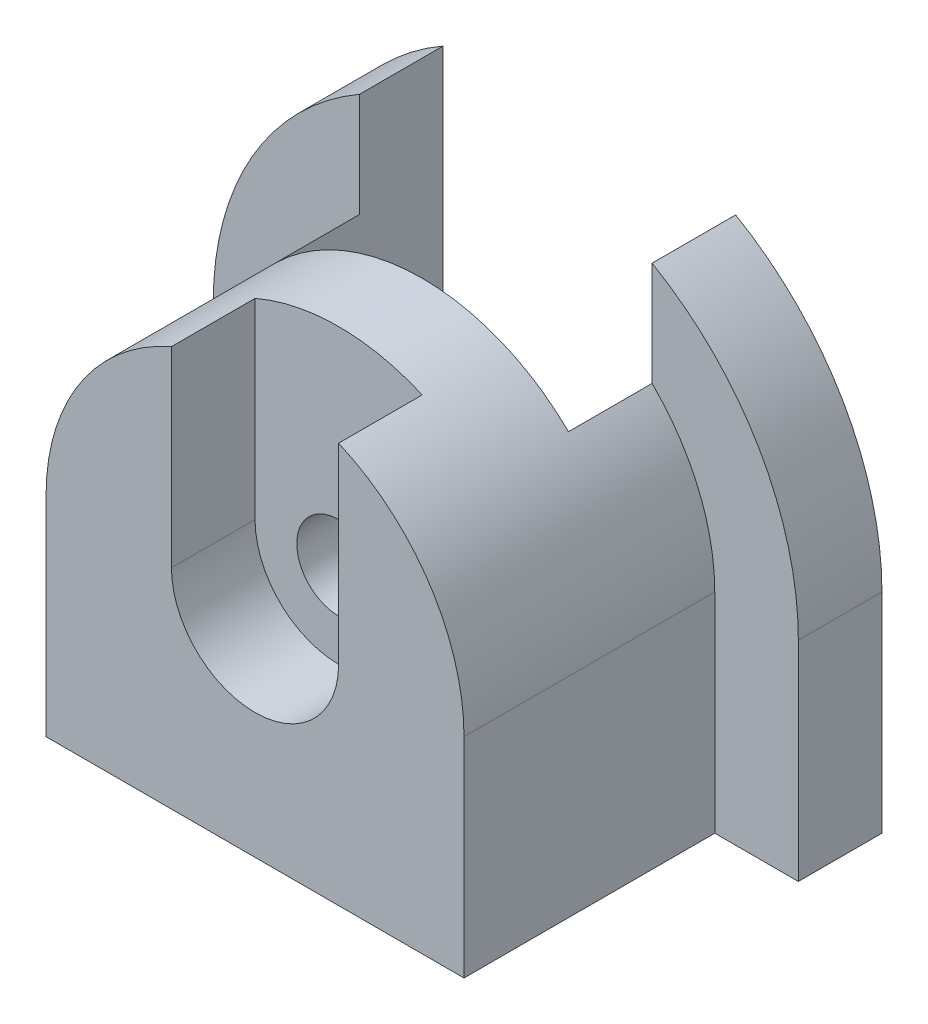
ISO-10303-21;
HEADER;
FILE_DESCRIPTION(('STEP AP214'),'2;1');
FILE_NAME('part.step','',(''),(''),'','','');
FILE_SCHEMA(('AUTOMOTIVE_DESIGN { 1 0 10303 214 1 1 1 1 }'));
ENDSEC;
DATA;
#1=APPLICATION_CONTEXT('core data for automotive mechanical design processes');
#2=APPLICATION_PROTOCOL_DEFINITION('international standard','automotive_design',2000,#1);
#3=PRODUCT_CONTEXT('',#1,'mechanical');
#4=PRODUCT('Part','Part','',(#3));
#5=PRODUCT_RELATED_PRODUCT_CATEGORY('part','',(#4));
#6=PRODUCT_DEFINITION_FORMATION('','',#4);
#7=PRODUCT_DEFINITION_CONTEXT('part definition',#1,'design');
#8=PRODUCT_DEFINITION('design','',#6,#7);
#9=PRODUCT_DEFINITION_SHAPE('','',#8);
#10=(LENGTH_UNIT() NAMED_UNIT(*) SI_UNIT(.MILLI.,.METRE.));
#11=(NAMED_UNIT(*) PLANE_ANGLE_UNIT() SI_UNIT($,.RADIAN.));
#12=(NAMED_UNIT(*) SI_UNIT($,.STERADIAN.) SOLID_ANGLE_UNIT());
#13=UNCERTAINTY_MEASURE_WITH_UNIT(LENGTH_MEASURE(1.E-05),#10,'distance_accuracy_value','');
#14=(GEOMETRIC_REPRESENTATION_CONTEXT(3) GLOBAL_UNCERTAINTY_ASSIGNED_CONTEXT((#13)) GLOBAL_UNIT_ASSIGNED_CONTEXT((#10,
#11,#12)) REPRESENTATION_CONTEXT('',''));
#15=CARTESIAN_POINT('',(0.,0.,0.));
#16=DIRECTION('',(0.,0.,1.));
#17=DIRECTION('',(1.,0.,0.));
#18=AXIS2_PLACEMENT_3D('',#15,#16,#17);
#19=CARTESIAN_POINT('',(0.,0.,-20.));
#20=DIRECTION('',(0.,0.,-1.));
#21=DIRECTION('',(-1.,0.,0.));
#22=AXIS2_PLACEMENT_3D('',#19,#20,#21);
#23=PLANE('',#22);
#24=DIRECTION('',(0.,1.,0.));
#25=VECTOR('',#24,1.);
#26=CARTESIAN_POINT('',(-20.,0.,-20.));
#27=LINE('',#26,#25);
#28=CARTESIAN_POINT('',(-20.,-50.,-20.));
#29=VERTEX_POINT('',#28);
#30=CARTESIAN_POINT('',(-20.,-28.7228132326901,-20.));
#31=VERTEX_POINT('',#30);
#32=EDGE_CURVE('E43',#29,#31,#27,.T.);
#33=ORIENTED_EDGE('',*,*,#32,.F.);
#34=DIRECTION('',(1.,0.,0.));
#35=VECTOR('',#34,1.);
#36=CARTESIAN_POINT('',(0.,-50.,-20.));
#37=LINE('',#36,#35);
#38=CARTESIAN_POINT('',(-70.,-50.,-20.));
#39=VERTEX_POINT('',#38);
#40=EDGE_CURVE('E198',#39,#29,#37,.T.);
#41=ORIENTED_EDGE('',*,*,#40,.F.);
#42=DIRECTION('',(0.,-1.,0.));
#43=VECTOR('',#42,1.);
#44=CARTESIAN_POINT('',(-70.,0.,-20.));
#45=LINE('',#44,#43);
#46=CARTESIAN_POINT('',(-70.,0.,-20.));
#47=VERTEX_POINT('',#46);
#48=EDGE_CURVE('E682',#47,#39,#45,.T.);
#49=ORIENTED_EDGE('',*,*,#48,.F.);
#50=CARTESIAN_POINT('',(0.,0.,-20.));
#51=DIRECTION('',(0.,0.,-1.));
#52=DIRECTION('',(-1.,0.,0.));
#53=AXIS2_PLACEMENT_3D('',#50,#51,#52);
#54=CIRCLE('',#53,70.);
#55=CARTESIAN_POINT('',(-35.,60.6217782649107,-20.));
#56=VERTEX_POINT('',#55);
#57=EDGE_CURVE('E685',#47,#56,#54,.T.);
#58=ORIENTED_EDGE('',*,*,#57,.T.);
#59=DIRECTION('',(0.,-1.,0.));
#60=VECTOR('',#59,1.);
#61=CARTESIAN_POINT('',(-35.,0.,-20.));
#62=LINE('',#61,#60);
#63=CARTESIAN_POINT('',(-35.,0.,-20.));
#64=VERTEX_POINT('',#63);
#65=EDGE_CURVE('E680',#56,#64,#62,.T.);
#66=ORIENTED_EDGE('',*,*,#65,.T.);
#67=CARTESIAN_POINT('',(0.,0.,-20.));
#68=DIRECTION('',(0.,0.,-1.));
#69=DIRECTION('',(-1.,0.,0.));
#70=AXIS2_PLACEMENT_3D('',#67,#68,#69);
#71=CIRCLE('',#70,35.);
#72=EDGE_CURVE('E202',#64,#31,#71,.F.);
#73=ORIENTED_EDGE('',*,*,#72,.T.);
#74=EDGE_LOOP('',(#33,#41,#49,#58,#66,#73));
#75=FACE_BOUND('',#74,.T.);
#76=ADVANCED_FACE('F35',(#75),#23,.T.);
#77=CARTESIAN_POINT('',(35.,0.,20.));
#78=DIRECTION('',(-1.,0.,0.));
#79=DIRECTION('',(0.,0.,1.));
#80=AXIS2_PLACEMENT_3D('',#77,#78,#79);
#81=PLANE('',#80);
#82=DIRECTION('',(0.,-1.,0.));
#83=VECTOR('',#82,1.);
#84=CARTESIAN_POINT('',(35.,0.,-20.));
#85=LINE('',#84,#83);
#86=CARTESIAN_POINT('',(35.,60.6217782649107,-20.));
#87=VERTEX_POINT('',#86);
#88=CARTESIAN_POINT('',(35.,0.,-20.));
#89=VERTEX_POINT('',#88);
#90=EDGE_CURVE('E208',#87,#89,#85,.T.);
#91=ORIENTED_EDGE('',*,*,#90,.T.);
#92=DIRECTION('',(0.,0.,-1.));
#93=VECTOR('',#92,1.);
#94=CARTESIAN_POINT('',(35.,0.,20.));
#95=LINE('',#94,#93);
#96=CARTESIAN_POINT('',(35.,0.,20.));
#97=VERTEX_POINT('',#96);
#98=EDGE_CURVE('E272',#97,#89,#95,.T.);
#99=ORIENTED_EDGE('',*,*,#98,.F.);
#100=DIRECTION('',(0.,1.,0.));
#101=VECTOR('',#100,1.);
#102=CARTESIAN_POINT('',(35.,0.,20.));
#103=LINE('',#102,#101);
#104=CARTESIAN_POINT('',(35.,35.7071421427143,20.));
#105=VERTEX_POINT('',#104);
#106=EDGE_CURVE('E246',#97,#105,#103,.T.);
#107=ORIENTED_EDGE('',*,*,#106,.T.);
#108=DIRECTION('',(0.,0.,-1.));
#109=VECTOR('',#108,1.);
#110=CARTESIAN_POINT('',(35.,35.7071421427143,20.));
#111=LINE('',#110,#109);
#112=CARTESIAN_POINT('',(35.,35.7071421427143,0.));
#113=VERTEX_POINT('',#112);
#114=EDGE_CURVE('E255',#105,#113,#111,.T.);
#115=ORIENTED_EDGE('',*,*,#114,.T.);
#116=DIRECTION('',(0.,-1.,0.));
#117=VECTOR('',#116,1.);
#118=CARTESIAN_POINT('',(35.,0.,0.));
#119=LINE('',#118,#117);
#120=CARTESIAN_POINT('',(35.,60.6217782649107,0.));
#121=VERTEX_POINT('',#120);
#122=EDGE_CURVE('E232',#121,#113,#119,.T.);
#123=ORIENTED_EDGE('',*,*,#122,.F.);
#124=DIRECTION('',(0.,0.,1.));
#125=VECTOR('',#124,1.);
#126=CARTESIAN_POINT('',(35.,60.6217782649107,-20.));
#127=LINE('',#126,#125);
#128=EDGE_CURVE('E233',#87,#121,#127,.T.);
#129=ORIENTED_EDGE('',*,*,#128,.F.);
#130=EDGE_LOOP('',(#91,#99,#107,#115,#123,#129));
#131=FACE_BOUND('',#130,.T.);
#132=ADVANCED_FACE('F342',(#131),#81,.T.);
#133=CARTESIAN_POINT('',(-35.,0.,20.));
#134=DIRECTION('',(-1.,0.,0.));
#135=DIRECTION('',(0.,0.,1.));
#136=AXIS2_PLACEMENT_3D('',#133,#134,#135);
#137=PLANE('',#136);
#138=DIRECTION('',(0.,0.,-1.));
#139=VECTOR('',#138,1.);
#140=CARTESIAN_POINT('',(-35.,0.,20.));
#141=LINE('',#140,#139);
#142=CARTESIAN_POINT('',(-35.,0.,20.));
#143=VERTEX_POINT('',#142);
#144=EDGE_CURVE('E251',#143,#64,#141,.T.);
#145=ORIENTED_EDGE('',*,*,#144,.T.);
#146=ORIENTED_EDGE('',*,*,#65,.F.);
#147=DIRECTION('',(0.,0.,1.));
#148=VECTOR('',#147,1.);
#149=CARTESIAN_POINT('',(-35.,60.6217782649107,-20.));
#150=LINE('',#149,#148);
#151=CARTESIAN_POINT('',(-35.,60.6217782649107,0.));
#152=VERTEX_POINT('',#151);
#153=EDGE_CURVE('E687',#56,#152,#150,.T.);
#154=ORIENTED_EDGE('',*,*,#153,.T.);
#155=DIRECTION('',(0.,-1.,0.));
#156=VECTOR('',#155,1.);
#157=CARTESIAN_POINT('',(-35.,0.,0.));
#158=LINE('',#157,#156);
#159=CARTESIAN_POINT('',(-35.,35.7071421427143,0.));
#160=VERTEX_POINT('',#159);
#161=EDGE_CURVE('E384',#152,#160,#158,.T.);
#162=ORIENTED_EDGE('',*,*,#161,.T.);
#163=DIRECTION('',(0.,0.,-1.));
#164=VECTOR('',#163,1.);
#165=CARTESIAN_POINT('',(-35.,35.7071421427143,20.));
#166=LINE('',#165,#164);
#167=CARTESIAN_POINT('',(-35.,35.7071421427143,20.));
#168=VERTEX_POINT('',#167);
#169=EDGE_CURVE('E252',#168,#160,#166,.T.);
#170=ORIENTED_EDGE('',*,*,#169,.F.);
#171=DIRECTION('',(0.,1.,0.));
#172=VECTOR('',#171,1.);
#173=CARTESIAN_POINT('',(-35.,0.,20.));
#174=LINE('',#173,#172);
#175=EDGE_CURVE('E240',#143,#168,#174,.T.);
#176=ORIENTED_EDGE('',*,*,#175,.F.);
#177=EDGE_LOOP('',(#145,#146,#154,#162,#170,#176));
#178=FACE_BOUND('',#177,.T.);
#179=ADVANCED_FACE('F380',(#178),#137,.F.);
#180=CARTESIAN_POINT('',(0.,0.,60.));
#181=DIRECTION('',(0.,0.,-1.));
#182=DIRECTION('',(-1.,0.,0.));
#183=AXIS2_PLACEMENT_3D('',#180,#181,#182);
#184=CYLINDRICAL_SURFACE('',#183,50.);
#185=CARTESIAN_POINT('',(0.,0.,0.));
#186=DIRECTION('',(0.,0.,1.));
#187=DIRECTION('',(1.,0.,0.));
#188=AXIS2_PLACEMENT_3D('',#185,#186,#187);
#189=CIRCLE('',#188,50.);
#190=CARTESIAN_POINT('',(50.,0.,0.));
#191=VERTEX_POINT('',#190);
#192=EDGE_CURVE('E302',#113,#191,#189,.F.);
#193=ORIENTED_EDGE('',*,*,#192,.F.);
#194=ORIENTED_EDGE('',*,*,#114,.F.);
#195=CARTESIAN_POINT('',(0.,0.,20.));
#196=DIRECTION('',(0.,0.,-1.));
#197=DIRECTION('',(-1.,0.,0.));
#198=AXIS2_PLACEMENT_3D('',#195,#196,#197);
#199=CIRCLE('',#198,50.);
#200=EDGE_CURVE('E243',#168,#105,#199,.T.);
#201=ORIENTED_EDGE('',*,*,#200,.F.);
#202=ORIENTED_EDGE('',*,*,#169,.T.);
#203=CARTESIAN_POINT('',(-50.,0.,0.));
#204=VERTEX_POINT('',#203);
#205=EDGE_CURVE('E297',#204,#160,#189,.F.);
#206=ORIENTED_EDGE('',*,*,#205,.F.);
#207=DIRECTION('',(0.,0.,-1.));
#208=VECTOR('',#207,1.);
#209=CARTESIAN_POINT('',(-50.,0.,60.));
#210=LINE('',#209,#208);
#211=CARTESIAN_POINT('',(-50.,0.,60.));
#212=VERTEX_POINT('',#211);
#213=EDGE_CURVE('E320',#212,#204,#210,.T.);
#214=ORIENTED_EDGE('',*,*,#213,.F.);
#215=CARTESIAN_POINT('',(0.,0.,60.));
#216=DIRECTION('',(0.,0.,1.));
#217=DIRECTION('',(1.,0.,0.));
#218=AXIS2_PLACEMENT_3D('',#215,#216,#217);
#219=CIRCLE('',#218,50.);
#220=CARTESIAN_POINT('',(-20.,45.8257569495584,60.));
#221=VERTEX_POINT('',#220);
#222=EDGE_CURVE('E285',#212,#221,#219,.F.);
#223=ORIENTED_EDGE('',*,*,#222,.T.);
#224=DIRECTION('',(0.,0.,1.));
#225=VECTOR('',#224,1.);
#226=CARTESIAN_POINT('',(-20.,45.8257569495584,40.));
#227=LINE('',#226,#225);
#228=CARTESIAN_POINT('',(-20.,45.8257569495584,40.));
#229=VERTEX_POINT('',#228);
#230=EDGE_CURVE('E279',#229,#221,#227,.T.);
#231=ORIENTED_EDGE('',*,*,#230,.F.);
#232=CARTESIAN_POINT('',(0.,0.,40.));
#233=DIRECTION('',(0.,0.,1.));
#234=DIRECTION('',(-1.,0.,0.));
#235=AXIS2_PLACEMENT_3D('',#232,#233,#234);
#236=CIRCLE('',#235,50.);
#237=CARTESIAN_POINT('',(20.,45.8257569495584,40.));
#238=VERTEX_POINT('',#237);
#239=EDGE_CURVE('E264',#238,#229,#236,.T.);
#240=ORIENTED_EDGE('',*,*,#239,.F.);
#241=DIRECTION('',(0.,0.,1.));
#242=VECTOR('',#241,1.);
#243=CARTESIAN_POINT('',(20.,45.8257569495584,40.));
#244=LINE('',#243,#242);
#245=CARTESIAN_POINT('',(20.,45.8257569495584,60.));
#246=VERTEX_POINT('',#245);
#247=EDGE_CURVE('E281',#238,#246,#244,.T.);
#248=ORIENTED_EDGE('',*,*,#247,.T.);
#249=CARTESIAN_POINT('',(50.,0.,60.));
#250=VERTEX_POINT('',#249);
#251=EDGE_CURVE('E289',#246,#250,#219,.F.);
#252=ORIENTED_EDGE('',*,*,#251,.T.);
#253=DIRECTION('',(0.,0.,-1.));
#254=VECTOR('',#253,1.);
#255=CARTESIAN_POINT('',(50.,0.,60.));
#256=LINE('',#255,#254);
#257=EDGE_CURVE('E296',#250,#191,#256,.T.);
#258=ORIENTED_EDGE('',*,*,#257,.T.);
#259=EDGE_LOOP('',(#193,#194,#201,#202,#206,#214,#223,#231,#240,#248,#252,#258));
#260=FACE_BOUND('',#259,.T.);
#261=ADVANCED_FACE('F37',(#260),#184,.T.);
#262=CARTESIAN_POINT('',(0.,0.,0.));
#263=DIRECTION('',(0.,0.,1.));
#264=DIRECTION('',(1.,0.,0.));
#265=AXIS2_PLACEMENT_3D('',#262,#263,#264);
#266=CYLINDRICAL_SURFACE('',#265,10.);
#267=CARTESIAN_POINT('',(0.,0.,40.));
#268=DIRECTION('',(0.,0.,-1.));
#269=DIRECTION('',(-1.,0.,0.));
#270=AXIS2_PLACEMENT_3D('',#267,#268,#269);
#271=CIRCLE('',#270,10.);
#272=CARTESIAN_POINT('',(-10.,0.,40.));
#273=VERTEX_POINT('',#272);
#274=EDGE_CURVE('E278',#273,#273,#271,.F.);
#275=ORIENTED_EDGE('',*,*,#274,.T.);
#276=EDGE_LOOP('',(#275));
#277=FACE_BOUND('',#276,.T.);
#278=CARTESIAN_POINT('',(0.,0.,20.));
#279=DIRECTION('',(0.,0.,-1.));
#280=DIRECTION('',(-1.,0.,0.));
#281=AXIS2_PLACEMENT_3D('',#278,#279,#280);
#282=CIRCLE('',#281,10.);
#283=CARTESIAN_POINT('',(-10.,0.,20.));
#284=VERTEX_POINT('',#283);
#285=EDGE_CURVE('E248',#284,#284,#282,.F.);
#286=ORIENTED_EDGE('',*,*,#285,.F.);
#287=EDGE_LOOP('',(#286));
#288=FACE_BOUND('',#287,.T.);
#289=ADVANCED_FACE('F580',(#277,#288),#266,.F.);
#290=CARTESIAN_POINT('',(-50.,0.,60.));
#291=DIRECTION('',(1.,0.,0.));
#292=DIRECTION('',(0.,1.,0.));
#293=AXIS2_PLACEMENT_3D('',#290,#291,#292);
#294=PLANE('',#293);
#295=DIRECTION('',(0.,-1.,0.));
#296=VECTOR('',#295,1.);
#297=CARTESIAN_POINT('',(-50.,0.,0.));
#298=LINE('',#297,#296);
#299=CARTESIAN_POINT('',(-50.,-50.,0.));
#300=VERTEX_POINT('',#299);
#301=EDGE_CURVE('E301',#204,#300,#298,.T.);
#302=ORIENTED_EDGE('',*,*,#301,.T.);
#303=DIRECTION('',(0.,0.,-1.));
#304=VECTOR('',#303,1.);
#305=CARTESIAN_POINT('',(-50.,-50.,60.));
#306=LINE('',#305,#304);
#307=CARTESIAN_POINT('',(-50.,-50.,60.));
#308=VERTEX_POINT('',#307);
#309=EDGE_CURVE('E317',#308,#300,#306,.T.);
#310=ORIENTED_EDGE('',*,*,#309,.F.);
#311=DIRECTION('',(0.,-1.,0.));
#312=VECTOR('',#311,1.);
#313=CARTESIAN_POINT('',(-50.,0.,60.));
#314=LINE('',#313,#312);
#315=EDGE_CURVE('E288',#212,#308,#314,.T.);
#316=ORIENTED_EDGE('',*,*,#315,.F.);
#317=ORIENTED_EDGE('',*,*,#213,.T.);
#318=EDGE_LOOP('',(#302,#310,#316,#317));
#319=FACE_BOUND('',#318,.T.);
#320=ADVANCED_FACE('F391',(#319),#294,.F.);
#321=CARTESIAN_POINT('',(0.,-50.,60.));
#322=DIRECTION('',(0.,1.,0.));
#323=DIRECTION('',(0.,0.,1.));
#324=AXIS2_PLACEMENT_3D('',#321,#322,#323);
#325=PLANE('',#324);
#326=ORIENTED_EDGE('',*,*,#40,.T.);
#327=DIRECTION('',(0.,0.,-1.));
#328=VECTOR('',#327,1.);
#329=CARTESIAN_POINT('',(-20.,-50.,-20.));
#330=LINE('',#329,#328);
#331=CARTESIAN_POINT('',(-20.,-50.,-10.));
#332=VERTEX_POINT('',#331);
#333=EDGE_CURVE('E183',#332,#29,#330,.T.);
#334=ORIENTED_EDGE('',*,*,#333,.F.);
#335=DIRECTION('',(-1.,0.,0.));
#336=VECTOR('',#335,1.);
#337=CARTESIAN_POINT('',(-20.,-50.,-10.));
#338=LINE('',#337,#336);
#339=CARTESIAN_POINT('',(20.,-50.,-10.));
#340=VERTEX_POINT('',#339);
#341=EDGE_CURVE('E674',#340,#332,#338,.T.);
#342=ORIENTED_EDGE('',*,*,#341,.F.);
#343=DIRECTION('',(0.,0.,1.));
#344=VECTOR('',#343,1.);
#345=CARTESIAN_POINT('',(20.,-50.,-20.));
#346=LINE('',#345,#344);
#347=CARTESIAN_POINT('',(20.,-50.,-20.));
#348=VERTEX_POINT('',#347);
#349=EDGE_CURVE('E193',#348,#340,#346,.T.);
#350=ORIENTED_EDGE('',*,*,#349,.F.);
#351=CARTESIAN_POINT('',(70.,-50.,-20.));
#352=VERTEX_POINT('',#351);
#353=EDGE_CURVE('E209',#348,#352,#37,.T.);
#354=ORIENTED_EDGE('',*,*,#353,.T.);
#355=DIRECTION('',(0.,0.,1.));
#356=VECTOR('',#355,1.);
#357=CARTESIAN_POINT('',(70.,-50.,-20.));
#358=LINE('',#357,#356);
#359=CARTESIAN_POINT('',(70.,-50.,0.));
#360=VERTEX_POINT('',#359);
#361=EDGE_CURVE('E223',#352,#360,#358,.T.);
#362=ORIENTED_EDGE('',*,*,#361,.T.);
#363=DIRECTION('',(1.,0.,0.));
#364=VECTOR('',#363,1.);
#365=CARTESIAN_POINT('',(0.,-50.,0.));
#366=LINE('',#365,#364);
#367=CARTESIAN_POINT('',(50.,-50.,0.));
#368=VERTEX_POINT('',#367);
#369=EDGE_CURVE('E229',#368,#360,#366,.T.);
#370=ORIENTED_EDGE('',*,*,#369,.F.);
#371=DIRECTION('',(0.,0.,-1.));
#372=VECTOR('',#371,1.);
#373=CARTESIAN_POINT('',(50.,-50.,60.));
#374=LINE('',#373,#372);
#375=CARTESIAN_POINT('',(50.,-50.,60.));
#376=VERTEX_POINT('',#375);
#377=EDGE_CURVE('E314',#376,#368,#374,.T.);
#378=ORIENTED_EDGE('',*,*,#377,.F.);
#379=DIRECTION('',(1.,0.,0.));
#380=VECTOR('',#379,1.);
#381=CARTESIAN_POINT('',(0.,-50.,60.));
#382=LINE('',#381,#380);
#383=EDGE_CURVE('E291',#308,#376,#382,.T.);
#384=ORIENTED_EDGE('',*,*,#383,.F.);
#385=ORIENTED_EDGE('',*,*,#309,.T.);
#386=DIRECTION('',(-1.,0.,0.));
#387=VECTOR('',#386,1.);
#388=CARTESIAN_POINT('',(0.,-50.,0.));
#389=LINE('',#388,#387);
#390=CARTESIAN_POINT('',(-70.,-50.,0.));
#391=VERTEX_POINT('',#390);
#392=EDGE_CURVE('E389',#300,#391,#389,.T.);
#393=ORIENTED_EDGE('',*,*,#392,.T.);
#394=DIRECTION('',(0.,0.,1.));
#395=VECTOR('',#394,1.);
#396=CARTESIAN_POINT('',(-70.,-50.,-20.));
#397=LINE('',#396,#395);
#398=EDGE_CURVE('E206',#39,#391,#397,.T.);
#399=ORIENTED_EDGE('',*,*,#398,.F.);
#400=EDGE_LOOP('',(#326,#334,#342,#350,#354,#362,#370,#378,#384,#385,#393,#399));
#401=FACE_BOUND('',#400,.T.);
#402=ADVANCED_FACE('F204',(#401),#325,.F.);
#403=CARTESIAN_POINT('',(50.,0.,60.));
#404=DIRECTION('',(-1.,0.,0.));
#405=DIRECTION('',(0.,-1.,0.));
#406=AXIS2_PLACEMENT_3D('',#403,#404,#405);
#407=PLANE('',#406);
#408=DIRECTION('',(0.,1.,0.));
#409=VECTOR('',#408,1.);
#410=CARTESIAN_POINT('',(50.,0.,0.));
#411=LINE('',#410,#409);
#412=EDGE_CURVE('E309',#368,#191,#411,.T.);
#413=ORIENTED_EDGE('',*,*,#412,.T.);
#414=ORIENTED_EDGE('',*,*,#257,.F.);
#415=DIRECTION('',(0.,1.,0.));
#416=VECTOR('',#415,1.);
#417=CARTESIAN_POINT('',(50.,0.,60.));
#418=LINE('',#417,#416);
#419=EDGE_CURVE('E293',#376,#250,#418,.T.);
#420=ORIENTED_EDGE('',*,*,#419,.F.);
#421=ORIENTED_EDGE('',*,*,#377,.T.);
#422=EDGE_LOOP('',(#413,#414,#420,#421));
#423=FACE_BOUND('',#422,.T.);
#424=ADVANCED_FACE('F540',(#423),#407,.F.);
#425=CARTESIAN_POINT('',(0.,0.,60.));
#426=DIRECTION('',(0.,0.,1.));
#427=DIRECTION('',(1.,0.,0.));
#428=AXIS2_PLACEMENT_3D('',#425,#426,#427);
#429=PLANE('',#428);
#430=DIRECTION('',(0.,-1.,0.));
#431=VECTOR('',#430,1.);
#432=CARTESIAN_POINT('',(-20.,0.,60.));
#433=LINE('',#432,#431);
#434=CARTESIAN_POINT('',(-20.,0.,60.));
#435=VERTEX_POINT('',#434);
#436=EDGE_CURVE('E261',#221,#435,#433,.T.);
#437=ORIENTED_EDGE('',*,*,#436,.F.);
#438=ORIENTED_EDGE('',*,*,#222,.F.);
#439=ORIENTED_EDGE('',*,*,#315,.T.);
#440=ORIENTED_EDGE('',*,*,#383,.T.);
#441=ORIENTED_EDGE('',*,*,#419,.T.);
#442=ORIENTED_EDGE('',*,*,#251,.F.);
#443=DIRECTION('',(0.,1.,0.));
#444=VECTOR('',#443,1.);
#445=CARTESIAN_POINT('',(20.,0.,60.));
#446=LINE('',#445,#444);
#447=CARTESIAN_POINT('',(20.,0.,60.));
#448=VERTEX_POINT('',#447);
#449=EDGE_CURVE('E271',#448,#246,#446,.T.);
#450=ORIENTED_EDGE('',*,*,#449,.F.);
#451=CARTESIAN_POINT('',(0.,0.,60.));
#452=DIRECTION('',(0.,0.,1.));
#453=DIRECTION('',(-1.,0.,0.));
#454=AXIS2_PLACEMENT_3D('',#451,#452,#453);
#455=CIRCLE('',#454,20.);
#456=EDGE_CURVE('E58',#435,#448,#455,.T.);
#457=ORIENTED_EDGE('',*,*,#456,.F.);
#458=EDGE_LOOP('',(#437,#438,#439,#440,#441,#442,#450,#457));
#459=FACE_BOUND('',#458,.T.);
#460=ADVANCED_FACE('F397',(#459),#429,.T.);
#461=CARTESIAN_POINT('',(0.,0.,40.));
#462=DIRECTION('',(0.,0.,-1.));
#463=DIRECTION('',(-1.,0.,0.));
#464=AXIS2_PLACEMENT_3D('',#461,#462,#463);
#465=PLANE('',#464);
#466=CARTESIAN_POINT('',(0.,0.,40.));
#467=DIRECTION('',(0.,0.,1.));
#468=DIRECTION('',(-1.,0.,0.));
#469=AXIS2_PLACEMENT_3D('',#466,#467,#468);
#470=CIRCLE('',#469,20.);
#471=CARTESIAN_POINT('',(-20.,0.,40.));
#472=VERTEX_POINT('',#471);
#473=CARTESIAN_POINT('',(20.,0.,40.));
#474=VERTEX_POINT('',#473);
#475=EDGE_CURVE('E257',#472,#474,#470,.T.);
#476=ORIENTED_EDGE('',*,*,#475,.T.);
#477=DIRECTION('',(0.,1.,0.));
#478=VECTOR('',#477,1.);
#479=CARTESIAN_POINT('',(20.,0.,40.));
#480=LINE('',#479,#478);
#481=EDGE_CURVE('E260',#474,#238,#480,.T.);
#482=ORIENTED_EDGE('',*,*,#481,.T.);
#483=ORIENTED_EDGE('',*,*,#239,.T.);
#484=DIRECTION('',(0.,-1.,0.));
#485=VECTOR('',#484,1.);
#486=CARTESIAN_POINT('',(-20.,0.,40.));
#487=LINE('',#486,#485);
#488=EDGE_CURVE('E266',#229,#472,#487,.T.);
#489=ORIENTED_EDGE('',*,*,#488,.T.);
#490=EDGE_LOOP('',(#476,#482,#483,#489));
#491=FACE_BOUND('',#490,.T.);
#492=ORIENTED_EDGE('',*,*,#274,.F.);
#493=EDGE_LOOP('',(#492));
#494=FACE_BOUND('',#493,.T.);
#495=ADVANCED_FACE('F407',(#491,#494),#465,.F.);
#496=CARTESIAN_POINT('',(0.,0.,40.));
#497=DIRECTION('',(0.,0.,1.));
#498=DIRECTION('',(1.,0.,0.));
#499=AXIS2_PLACEMENT_3D('',#496,#497,#498);
#500=CYLINDRICAL_SURFACE('',#499,20.);
#501=ORIENTED_EDGE('',*,*,#456,.T.);
#502=DIRECTION('',(0.,0.,1.));
#503=VECTOR('',#502,1.);
#504=CARTESIAN_POINT('',(20.,0.,40.));
#505=LINE('',#504,#503);
#506=EDGE_CURVE('E269',#474,#448,#505,.T.);
#507=ORIENTED_EDGE('',*,*,#506,.F.);
#508=ORIENTED_EDGE('',*,*,#475,.F.);
#509=DIRECTION('',(0.,0.,1.));
#510=VECTOR('',#509,1.);
#511=CARTESIAN_POINT('',(-20.,0.,40.));
#512=LINE('',#511,#510);
#513=EDGE_CURVE('E276',#472,#435,#512,.T.);
#514=ORIENTED_EDGE('',*,*,#513,.T.);
#515=EDGE_LOOP('',(#501,#507,#508,#514));
#516=FACE_BOUND('',#515,.T.);
#517=ADVANCED_FACE('F413',(#516),#500,.F.);
#518=CARTESIAN_POINT('',(-20.,0.,40.));
#519=DIRECTION('',(-1.,0.,0.));
#520=DIRECTION('',(0.,0.,1.));
#521=AXIS2_PLACEMENT_3D('',#518,#519,#520);
#522=PLANE('',#521);
#523=ORIENTED_EDGE('',*,*,#436,.T.);
#524=ORIENTED_EDGE('',*,*,#513,.F.);
#525=ORIENTED_EDGE('',*,*,#488,.F.);
#526=ORIENTED_EDGE('',*,*,#230,.T.);
#527=EDGE_LOOP('',(#523,#524,#525,#526));
#528=FACE_BOUND('',#527,.T.);
#529=ADVANCED_FACE('F404',(#528),#522,.F.);
#530=CARTESIAN_POINT('',(20.,0.,40.));
#531=DIRECTION('',(1.,0.,0.));
#532=DIRECTION('',(0.,0.,-1.));
#533=AXIS2_PLACEMENT_3D('',#530,#531,#532);
#534=PLANE('',#533);
#535=ORIENTED_EDGE('',*,*,#449,.T.);
#536=ORIENTED_EDGE('',*,*,#247,.F.);
#537=ORIENTED_EDGE('',*,*,#481,.F.);
#538=ORIENTED_EDGE('',*,*,#506,.T.);
#539=EDGE_LOOP('',(#535,#536,#537,#538));
#540=FACE_BOUND('',#539,.T.);
#541=ADVANCED_FACE('F411',(#540),#534,.F.);
#542=CARTESIAN_POINT('',(0.,0.,20.));
#543=DIRECTION('',(0.,0.,-1.));
#544=DIRECTION('',(-1.,0.,0.));
#545=AXIS2_PLACEMENT_3D('',#542,#543,#544);
#546=CYLINDRICAL_SURFACE('',#545,35.);
#547=DIRECTION('',(0.,0.,-1.));
#548=VECTOR('',#547,1.);
#549=CARTESIAN_POINT('',(-20.,-28.7228132326901,20.));
#550=LINE('',#549,#548);
#551=CARTESIAN_POINT('',(-20.,-28.7228132326901,-10.));
#552=VERTEX_POINT('',#551);
#553=EDGE_CURVE('E371',#31,#552,#550,.F.);
#554=ORIENTED_EDGE('',*,*,#553,.F.);
#555=ORIENTED_EDGE('',*,*,#72,.F.);
#556=ORIENTED_EDGE('',*,*,#144,.F.);
#557=CARTESIAN_POINT('',(0.,0.,20.));
#558=DIRECTION('',(0.,0.,-1.));
#559=DIRECTION('',(-1.,0.,0.));
#560=AXIS2_PLACEMENT_3D('',#557,#558,#559);
#561=CIRCLE('',#560,35.);
#562=EDGE_CURVE('E237',#143,#97,#561,.F.);
#563=ORIENTED_EDGE('',*,*,#562,.T.);
#564=ORIENTED_EDGE('',*,*,#98,.T.);
#565=CARTESIAN_POINT('',(20.,-28.7228132326901,-20.));
#566=VERTEX_POINT('',#565);
#567=EDGE_CURVE('E368',#566,#89,#71,.F.);
#568=ORIENTED_EDGE('',*,*,#567,.F.);
#569=DIRECTION('',(0.,0.,-1.));
#570=VECTOR('',#569,1.);
#571=CARTESIAN_POINT('',(20.,-28.7228132326901,20.));
#572=LINE('',#571,#570);
#573=CARTESIAN_POINT('',(20.,-28.7228132326901,-10.));
#574=VERTEX_POINT('',#573);
#575=EDGE_CURVE('E50',#574,#566,#572,.T.);
#576=ORIENTED_EDGE('',*,*,#575,.F.);
#577=CARTESIAN_POINT('',(0.,0.,-10.));
#578=DIRECTION('',(0.,0.,1.));
#579=DIRECTION('',(1.,0.,0.));
#580=AXIS2_PLACEMENT_3D('',#577,#578,#579);
#581=CIRCLE('',#580,35.);
#582=EDGE_CURVE('E11',#552,#574,#581,.T.);
#583=ORIENTED_EDGE('',*,*,#582,.F.);
#584=EDGE_LOOP('',(#554,#555,#556,#563,#564,#568,#576,#583));
#585=FACE_BOUND('',#584,.T.);
#586=ADVANCED_FACE('F373',(#585),#546,.F.);
#587=CARTESIAN_POINT('',(0.,0.,20.));
#588=DIRECTION('',(0.,0.,-1.));
#589=DIRECTION('',(-1.,0.,0.));
#590=AXIS2_PLACEMENT_3D('',#587,#588,#589);
#591=PLANE('',#590);
#592=ORIENTED_EDGE('',*,*,#562,.F.);
#593=ORIENTED_EDGE('',*,*,#175,.T.);
#594=ORIENTED_EDGE('',*,*,#200,.T.);
#595=ORIENTED_EDGE('',*,*,#106,.F.);
#596=EDGE_LOOP('',(#592,#593,#594,#595));
#597=FACE_BOUND('',#596,.T.);
#598=ORIENTED_EDGE('',*,*,#285,.T.);
#599=EDGE_LOOP('',(#598));
#600=FACE_BOUND('',#599,.T.);
#601=ADVANCED_FACE('F377',(#597,#600),#591,.T.);
#602=CARTESIAN_POINT('',(0.,0.,0.));
#603=DIRECTION('',(0.,0.,-1.));
#604=DIRECTION('',(-1.,0.,0.));
#605=AXIS2_PLACEMENT_3D('',#602,#603,#604);
#606=PLANE('',#605);
#607=ORIENTED_EDGE('',*,*,#122,.T.);
#608=ORIENTED_EDGE('',*,*,#192,.T.);
#609=ORIENTED_EDGE('',*,*,#412,.F.);
#610=ORIENTED_EDGE('',*,*,#369,.T.);
#611=DIRECTION('',(0.,1.,0.));
#612=VECTOR('',#611,1.);
#613=CARTESIAN_POINT('',(70.,0.,0.));
#614=LINE('',#613,#612);
#615=CARTESIAN_POINT('',(70.,0.,0.));
#616=VERTEX_POINT('',#615);
#617=EDGE_CURVE('E214',#360,#616,#614,.T.);
#618=ORIENTED_EDGE('',*,*,#617,.T.);
#619=CARTESIAN_POINT('',(0.,0.,0.));
#620=DIRECTION('',(0.,0.,-1.));
#621=DIRECTION('',(-1.,0.,0.));
#622=AXIS2_PLACEMENT_3D('',#619,#620,#621);
#623=CIRCLE('',#622,70.);
#624=EDGE_CURVE('E236',#616,#121,#623,.F.);
#625=ORIENTED_EDGE('',*,*,#624,.T.);
#626=EDGE_LOOP('',(#607,#608,#609,#610,#618,#625));
#627=FACE_BOUND('',#626,.T.);
#628=ADVANCED_FACE('F350',(#627),#606,.F.);
#629=CARTESIAN_POINT('',(0.,0.,-20.));
#630=DIRECTION('',(0.,0.,1.));
#631=DIRECTION('',(1.,0.,0.));
#632=AXIS2_PLACEMENT_3D('',#629,#630,#631);
#633=CYLINDRICAL_SURFACE('',#632,70.);
#634=ORIENTED_EDGE('',*,*,#624,.F.);
#635=DIRECTION('',(0.,0.,1.));
#636=VECTOR('',#635,1.);
#637=CARTESIAN_POINT('',(70.,0.,-20.));
#638=LINE('',#637,#636);
#639=CARTESIAN_POINT('',(70.,0.,-20.));
#640=VERTEX_POINT('',#639);
#641=EDGE_CURVE('E359',#640,#616,#638,.T.);
#642=ORIENTED_EDGE('',*,*,#641,.F.);
#643=CARTESIAN_POINT('',(0.,0.,-20.));
#644=DIRECTION('',(0.,0.,-1.));
#645=DIRECTION('',(-1.,0.,0.));
#646=AXIS2_PLACEMENT_3D('',#643,#644,#645);
#647=CIRCLE('',#646,70.);
#648=EDGE_CURVE('E212',#640,#87,#647,.F.);
#649=ORIENTED_EDGE('',*,*,#648,.T.);
#650=ORIENTED_EDGE('',*,*,#128,.T.);
#651=EDGE_LOOP('',(#634,#642,#649,#650));
#652=FACE_BOUND('',#651,.T.);
#653=ADVANCED_FACE('F361',(#652),#633,.T.);
#654=CARTESIAN_POINT('',(70.,0.,-20.));
#655=DIRECTION('',(1.,0.,0.));
#656=DIRECTION('',(0.,0.,-1.));
#657=AXIS2_PLACEMENT_3D('',#654,#655,#656);
#658=PLANE('',#657);
#659=ORIENTED_EDGE('',*,*,#617,.F.);
#660=ORIENTED_EDGE('',*,*,#361,.F.);
#661=DIRECTION('',(0.,1.,0.));
#662=VECTOR('',#661,1.);
#663=CARTESIAN_POINT('',(70.,0.,-20.));
#664=LINE('',#663,#662);
#665=EDGE_CURVE('E220',#352,#640,#664,.T.);
#666=ORIENTED_EDGE('',*,*,#665,.T.);
#667=ORIENTED_EDGE('',*,*,#641,.T.);
#668=EDGE_LOOP('',(#659,#660,#666,#667));
#669=FACE_BOUND('',#668,.T.);
#670=ADVANCED_FACE('F434',(#669),#658,.T.);
#671=DIRECTION('',(0.,-1.,0.));
#672=VECTOR('',#671,1.);
#673=CARTESIAN_POINT('',(20.,0.,-20.));
#674=LINE('',#673,#672);
#675=EDGE_CURVE('E203',#566,#348,#674,.T.);
#676=ORIENTED_EDGE('',*,*,#675,.F.);
#677=ORIENTED_EDGE('',*,*,#567,.T.);
#678=ORIENTED_EDGE('',*,*,#90,.F.);
#679=ORIENTED_EDGE('',*,*,#648,.F.);
#680=ORIENTED_EDGE('',*,*,#665,.F.);
#681=ORIENTED_EDGE('',*,*,#353,.F.);
#682=EDGE_LOOP('',(#676,#677,#678,#679,#680,#681));
#683=FACE_BOUND('',#682,.T.);
#684=ADVANCED_FACE('F365',(#683),#23,.T.);
#685=CARTESIAN_POINT('',(-70.,0.,-20.));
#686=DIRECTION('',(-1.,0.,0.));
#687=DIRECTION('',(0.,0.,1.));
#688=AXIS2_PLACEMENT_3D('',#685,#686,#687);
#689=PLANE('',#688);
#690=DIRECTION('',(0.,-1.,0.));
#691=VECTOR('',#690,1.);
#692=CARTESIAN_POINT('',(-70.,0.,0.));
#693=LINE('',#692,#691);
#694=CARTESIAN_POINT('',(-70.,0.,0.));
#695=VERTEX_POINT('',#694);
#696=EDGE_CURVE('E690',#695,#391,#693,.T.);
#697=ORIENTED_EDGE('',*,*,#696,.F.);
#698=DIRECTION('',(0.,0.,1.));
#699=VECTOR('',#698,1.);
#700=CARTESIAN_POINT('',(-70.,0.,-20.));
#701=LINE('',#700,#699);
#702=EDGE_CURVE('E693',#47,#695,#701,.T.);
#703=ORIENTED_EDGE('',*,*,#702,.F.);
#704=ORIENTED_EDGE('',*,*,#48,.T.);
#705=ORIENTED_EDGE('',*,*,#398,.T.);
#706=EDGE_LOOP('',(#697,#703,#704,#705));
#707=FACE_BOUND('',#706,.T.);
#708=ADVANCED_FACE('F433',(#707),#689,.T.);
#709=CARTESIAN_POINT('',(0.,0.,-20.));
#710=DIRECTION('',(0.,0.,1.));
#711=DIRECTION('',(1.,0.,0.));
#712=AXIS2_PLACEMENT_3D('',#709,#710,#711);
#713=CYLINDRICAL_SURFACE('',#712,70.);
#714=CARTESIAN_POINT('',(0.,0.,0.));
#715=DIRECTION('',(0.,0.,-1.));
#716=DIRECTION('',(-1.,0.,0.));
#717=AXIS2_PLACEMENT_3D('',#714,#715,#716);
#718=CIRCLE('',#717,70.);
#719=EDGE_CURVE('E683',#695,#152,#718,.T.);
#720=ORIENTED_EDGE('',*,*,#719,.T.);
#721=ORIENTED_EDGE('',*,*,#153,.F.);
#722=ORIENTED_EDGE('',*,*,#57,.F.);
#723=ORIENTED_EDGE('',*,*,#702,.T.);
#724=EDGE_LOOP('',(#720,#721,#722,#723));
#725=FACE_BOUND('',#724,.T.);
#726=ADVANCED_FACE('F439',(#725),#713,.T.);
#727=CARTESIAN_POINT('',(0.,0.,0.));
#728=DIRECTION('',(0.,0.,-1.));
#729=DIRECTION('',(-1.,0.,0.));
#730=AXIS2_PLACEMENT_3D('',#727,#728,#729);
#731=PLANE('',#730);
#732=ORIENTED_EDGE('',*,*,#205,.T.);
#733=ORIENTED_EDGE('',*,*,#161,.F.);
#734=ORIENTED_EDGE('',*,*,#719,.F.);
#735=ORIENTED_EDGE('',*,*,#696,.T.);
#736=ORIENTED_EDGE('',*,*,#392,.F.);
#737=ORIENTED_EDGE('',*,*,#301,.F.);
#738=EDGE_LOOP('',(#732,#733,#734,#735,#736,#737));
#739=FACE_BOUND('',#738,.T.);
#740=ADVANCED_FACE('F386',(#739),#731,.F.);
#741=CARTESIAN_POINT('',(-20.,45.,-20.));
#742=DIRECTION('',(-1.,0.,0.));
#743=DIRECTION('',(0.,0.,1.));
#744=AXIS2_PLACEMENT_3D('',#741,#742,#743);
#745=PLANE('',#744);
#746=ORIENTED_EDGE('',*,*,#553,.T.);
#747=DIRECTION('',(0.,-1.,0.));
#748=VECTOR('',#747,1.);
#749=CARTESIAN_POINT('',(-20.,45.,-10.));
#750=LINE('',#749,#748);
#751=EDGE_CURVE('E188',#552,#332,#750,.T.);
#752=ORIENTED_EDGE('',*,*,#751,.T.);
#753=ORIENTED_EDGE('',*,*,#333,.T.);
#754=ORIENTED_EDGE('',*,*,#32,.T.);
#755=EDGE_LOOP('',(#746,#752,#753,#754));
#756=FACE_BOUND('',#755,.T.);
#757=ADVANCED_FACE('F185',(#756),#745,.F.);
#758=CARTESIAN_POINT('',(-20.,45.,-10.));
#759=DIRECTION('',(0.,0.,1.));
#760=DIRECTION('',(1.,0.,0.));
#761=AXIS2_PLACEMENT_3D('',#758,#759,#760);
#762=PLANE('',#761);
#763=ORIENTED_EDGE('',*,*,#582,.T.);
#764=DIRECTION('',(0.,-1.,0.));
#765=VECTOR('',#764,1.);
#766=CARTESIAN_POINT('',(20.,45.,-10.));
#767=LINE('',#766,#765);
#768=EDGE_CURVE('E673',#574,#340,#767,.T.);
#769=ORIENTED_EDGE('',*,*,#768,.T.);
#770=ORIENTED_EDGE('',*,*,#341,.T.);
#771=ORIENTED_EDGE('',*,*,#751,.F.);
#772=EDGE_LOOP('',(#763,#769,#770,#771));
#773=FACE_BOUND('',#772,.T.);
#774=ADVANCED_FACE('F650',(#773),#762,.F.);
#775=CARTESIAN_POINT('',(20.,45.,-20.));
#776=DIRECTION('',(1.,0.,0.));
#777=DIRECTION('',(0.,0.,-1.));
#778=AXIS2_PLACEMENT_3D('',#775,#776,#777);
#779=PLANE('',#778);
#780=ORIENTED_EDGE('',*,*,#575,.T.);
#781=ORIENTED_EDGE('',*,*,#675,.T.);
#782=ORIENTED_EDGE('',*,*,#349,.T.);
#783=ORIENTED_EDGE('',*,*,#768,.F.);
#784=EDGE_LOOP('',(#780,#781,#782,#783));
#785=FACE_BOUND('',#784,.T.);
#786=ADVANCED_FACE('F659',(#785),#779,.F.);
#787=CLOSED_SHELL('',(#76,#132,#179,#261,#289,#320,#402,#424,#460,#495,#517,#529,#541,#586,#601,
#628,#653,#670,#684,#708,#726,#740,#757,#774,#786));
#788=MANIFOLD_SOLID_BREP('B2',#787);
#789=ADVANCED_BREP_SHAPE_REPRESENTATION('',(#18,#788),#14);
#790=SHAPE_DEFINITION_REPRESENTATION(#9,#789);
ENDSEC;
END-ISO-10303-21;
